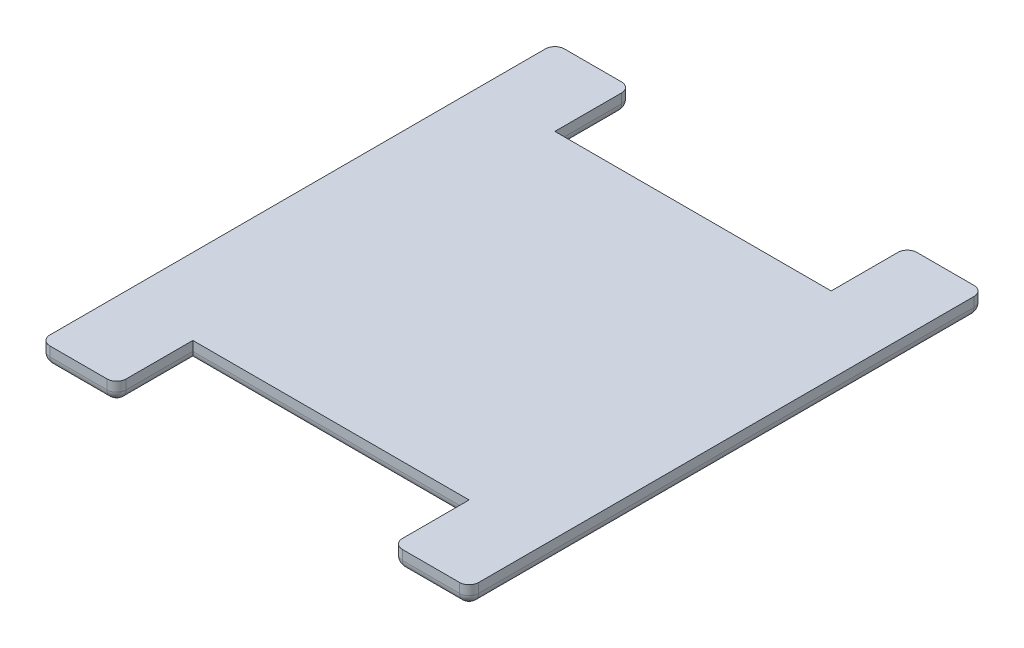
ISO-10303-21;
HEADER;
FILE_DESCRIPTION(('STEP AP214'),'2;1');
FILE_NAME('part.step','',(''),(''),'','','');
FILE_SCHEMA(('AUTOMOTIVE_DESIGN { 1 0 10303 214 1 1 1 1 }'));
ENDSEC;
DATA;
#1=APPLICATION_CONTEXT('core data for automotive mechanical design processes');
#2=APPLICATION_PROTOCOL_DEFINITION('international standard','automotive_design',2000,#1);
#3=PRODUCT_CONTEXT('',#1,'mechanical');
#4=PRODUCT('Part','Part','',(#3));
#5=PRODUCT_RELATED_PRODUCT_CATEGORY('part','',(#4));
#6=PRODUCT_DEFINITION_FORMATION('','',#4);
#7=PRODUCT_DEFINITION_CONTEXT('part definition',#1,'design');
#8=PRODUCT_DEFINITION('design','',#6,#7);
#9=PRODUCT_DEFINITION_SHAPE('','',#8);
#10=(LENGTH_UNIT() NAMED_UNIT(*) SI_UNIT(.MILLI.,.METRE.));
#11=(NAMED_UNIT(*) PLANE_ANGLE_UNIT() SI_UNIT($,.RADIAN.));
#12=(NAMED_UNIT(*) SI_UNIT($,.STERADIAN.) SOLID_ANGLE_UNIT());
#13=UNCERTAINTY_MEASURE_WITH_UNIT(LENGTH_MEASURE(1.E-05),#10,'distance_accuracy_value','');
#14=(GEOMETRIC_REPRESENTATION_CONTEXT(3) GLOBAL_UNCERTAINTY_ASSIGNED_CONTEXT((#13)) GLOBAL_UNIT_ASSIGNED_CONTEXT((#10,
#11,#12)) REPRESENTATION_CONTEXT('',''));
#15=CARTESIAN_POINT('',(0.,0.,0.));
#16=DIRECTION('',(0.,0.,1.));
#17=DIRECTION('',(1.,0.,0.));
#18=AXIS2_PLACEMENT_3D('',#15,#16,#17);
#19=CARTESIAN_POINT('',(14.5,-13.,-19.));
#20=DIRECTION('',(1.,0.,0.));
#21=DIRECTION('',(0.,0.,-1.));
#22=AXIS2_PLACEMENT_3D('',#19,#20,#21);
#23=PLANE('',#22);
#24=DIRECTION('',(0.,1.,0.));
#25=VECTOR('',#24,1.);
#26=CARTESIAN_POINT('',(14.5,-13.,-26.));
#27=LINE('',#26,#25);
#28=CARTESIAN_POINT('',(14.5,-11.,-26.));
#29=VERTEX_POINT('',#28);
#30=CARTESIAN_POINT('',(14.5,-12.,-26.));
#31=VERTEX_POINT('',#30);
#32=EDGE_CURVE('E56',#29,#31,#27,.F.);
#33=ORIENTED_EDGE('',*,*,#32,.T.);
#34=DIRECTION('',(0.,0.,-1.));
#35=VECTOR('',#34,1.);
#36=CARTESIAN_POINT('',(14.5,-12.,-19.));
#37=LINE('',#36,#35);
#38=CARTESIAN_POINT('',(14.5,-12.,-19.));
#39=VERTEX_POINT('',#38);
#40=EDGE_CURVE('E341',#31,#39,#37,.F.);
#41=ORIENTED_EDGE('',*,*,#40,.T.);
#42=DIRECTION('',(0.,1.,0.));
#43=VECTOR('',#42,1.);
#44=CARTESIAN_POINT('',(14.5,-13.,-19.));
#45=LINE('',#44,#43);
#46=CARTESIAN_POINT('',(14.5,-11.,-19.));
#47=VERTEX_POINT('',#46);
#48=EDGE_CURVE('E259',#39,#47,#45,.T.);
#49=ORIENTED_EDGE('',*,*,#48,.T.);
#50=DIRECTION('',(0.,0.,-1.));
#51=VECTOR('',#50,1.);
#52=CARTESIAN_POINT('',(14.5,-11.,-19.));
#53=LINE('',#52,#51);
#54=EDGE_CURVE('E436',#47,#29,#53,.T.);
#55=ORIENTED_EDGE('',*,*,#54,.T.);
#56=EDGE_LOOP('',(#33,#41,#49,#55));
#57=FACE_BOUND('',#56,.T.);
#58=ADVANCED_FACE('F39',(#57),#23,.F.);
#59=CARTESIAN_POINT('',(14.5,-13.,-27.));
#60=DIRECTION('',(0.,0.,1.));
#61=DIRECTION('',(1.,0.,0.));
#62=AXIS2_PLACEMENT_3D('',#59,#60,#61);
#63=PLANE('',#62);
#64=DIRECTION('',(1.,0.,0.));
#65=VECTOR('',#64,1.);
#66=CARTESIAN_POINT('',(14.5,-12.,-27.));
#67=LINE('',#66,#65);
#68=CARTESIAN_POINT('',(21.5,-12.,-27.));
#69=VERTEX_POINT('',#68);
#70=CARTESIAN_POINT('',(15.5,-12.,-27.));
#71=VERTEX_POINT('',#70);
#72=EDGE_CURVE('E336',#69,#71,#67,.F.);
#73=ORIENTED_EDGE('',*,*,#72,.T.);
#74=DIRECTION('',(0.,1.,0.));
#75=VECTOR('',#74,1.);
#76=CARTESIAN_POINT('',(15.5,-13.,-27.));
#77=LINE('',#76,#75);
#78=CARTESIAN_POINT('',(15.5,-11.,-27.));
#79=VERTEX_POINT('',#78);
#80=EDGE_CURVE('E338',#71,#79,#77,.T.);
#81=ORIENTED_EDGE('',*,*,#80,.T.);
#82=DIRECTION('',(1.,0.,0.));
#83=VECTOR('',#82,1.);
#84=CARTESIAN_POINT('',(14.5,-11.,-27.));
#85=LINE('',#84,#83);
#86=CARTESIAN_POINT('',(21.5,-11.,-27.));
#87=VERTEX_POINT('',#86);
#88=EDGE_CURVE('E441',#79,#87,#85,.T.);
#89=ORIENTED_EDGE('',*,*,#88,.T.);
#90=DIRECTION('',(0.,1.,0.));
#91=VECTOR('',#90,1.);
#92=CARTESIAN_POINT('',(21.5,-13.,-27.));
#93=LINE('',#92,#91);
#94=EDGE_CURVE('E334',#87,#69,#93,.F.);
#95=ORIENTED_EDGE('',*,*,#94,.T.);
#96=EDGE_LOOP('',(#73,#81,#89,#95));
#97=FACE_BOUND('',#96,.T.);
#98=ADVANCED_FACE('F496',(#97),#63,.F.);
#99=CARTESIAN_POINT('',(22.5,-13.,-27.));
#100=DIRECTION('',(-1.,0.,0.));
#101=DIRECTION('',(0.,0.,1.));
#102=AXIS2_PLACEMENT_3D('',#99,#100,#101);
#103=PLANE('',#102);
#104=DIRECTION('',(0.,0.,1.));
#105=VECTOR('',#104,1.);
#106=CARTESIAN_POINT('',(22.5,-11.,-27.));
#107=LINE('',#106,#105);
#108=CARTESIAN_POINT('',(22.5,-11.,-26.));
#109=VERTEX_POINT('',#108);
#110=CARTESIAN_POINT('',(22.5,-11.,26.));
#111=VERTEX_POINT('',#110);
#112=EDGE_CURVE('E444',#109,#111,#107,.T.);
#113=ORIENTED_EDGE('',*,*,#112,.T.);
#114=DIRECTION('',(0.,1.,0.));
#115=VECTOR('',#114,1.);
#116=CARTESIAN_POINT('',(22.5,-13.,26.));
#117=LINE('',#116,#115);
#118=CARTESIAN_POINT('',(22.5,-12.,26.));
#119=VERTEX_POINT('',#118);
#120=EDGE_CURVE('E332',#111,#119,#117,.F.);
#121=ORIENTED_EDGE('',*,*,#120,.T.);
#122=DIRECTION('',(0.,0.,1.));
#123=VECTOR('',#122,1.);
#124=CARTESIAN_POINT('',(22.5,-12.,-27.));
#125=LINE('',#124,#123);
#126=CARTESIAN_POINT('',(22.5,-12.,-26.));
#127=VERTEX_POINT('',#126);
#128=EDGE_CURVE('E330',#119,#127,#125,.F.);
#129=ORIENTED_EDGE('',*,*,#128,.T.);
#130=DIRECTION('',(0.,1.,0.));
#131=VECTOR('',#130,1.);
#132=CARTESIAN_POINT('',(22.5,-13.,-26.));
#133=LINE('',#132,#131);
#134=EDGE_CURVE('E328',#127,#109,#133,.T.);
#135=ORIENTED_EDGE('',*,*,#134,.T.);
#136=EDGE_LOOP('',(#113,#121,#129,#135));
#137=FACE_BOUND('',#136,.T.);
#138=ADVANCED_FACE('F475',(#137),#103,.F.);
#139=CARTESIAN_POINT('',(22.5,-13.,27.));
#140=DIRECTION('',(0.,0.,-1.));
#141=DIRECTION('',(-1.,0.,0.));
#142=AXIS2_PLACEMENT_3D('',#139,#140,#141);
#143=PLANE('',#142);
#144=DIRECTION('',(-1.,0.,0.));
#145=VECTOR('',#144,1.);
#146=CARTESIAN_POINT('',(22.5,-11.,27.));
#147=LINE('',#146,#145);
#148=CARTESIAN_POINT('',(21.5,-11.,27.));
#149=VERTEX_POINT('',#148);
#150=CARTESIAN_POINT('',(15.5,-11.,27.));
#151=VERTEX_POINT('',#150);
#152=EDGE_CURVE('E225',#149,#151,#147,.T.);
#153=ORIENTED_EDGE('',*,*,#152,.T.);
#154=DIRECTION('',(0.,1.,0.));
#155=VECTOR('',#154,1.);
#156=CARTESIAN_POINT('',(15.5,-13.,27.));
#157=LINE('',#156,#155);
#158=CARTESIAN_POINT('',(15.5,-12.,27.));
#159=VERTEX_POINT('',#158);
#160=EDGE_CURVE('E326',#151,#159,#157,.F.);
#161=ORIENTED_EDGE('',*,*,#160,.T.);
#162=DIRECTION('',(-1.,0.,0.));
#163=VECTOR('',#162,1.);
#164=CARTESIAN_POINT('',(22.5,-12.,27.));
#165=LINE('',#164,#163);
#166=CARTESIAN_POINT('',(21.5,-12.,27.));
#167=VERTEX_POINT('',#166);
#168=EDGE_CURVE('E324',#159,#167,#165,.F.);
#169=ORIENTED_EDGE('',*,*,#168,.T.);
#170=DIRECTION('',(0.,1.,0.));
#171=VECTOR('',#170,1.);
#172=CARTESIAN_POINT('',(21.5,-13.,27.));
#173=LINE('',#172,#171);
#174=EDGE_CURVE('E322',#167,#149,#173,.T.);
#175=ORIENTED_EDGE('',*,*,#174,.T.);
#176=EDGE_LOOP('',(#153,#161,#169,#175));
#177=FACE_BOUND('',#176,.T.);
#178=ADVANCED_FACE('F452',(#177),#143,.F.);
#179=CARTESIAN_POINT('',(14.5,-13.,27.));
#180=DIRECTION('',(1.,0.,0.));
#181=DIRECTION('',(0.,0.,-1.));
#182=AXIS2_PLACEMENT_3D('',#179,#180,#181);
#183=PLANE('',#182);
#184=DIRECTION('',(0.,1.,0.));
#185=VECTOR('',#184,1.);
#186=CARTESIAN_POINT('',(14.5,-13.,19.));
#187=LINE('',#186,#185);
#188=CARTESIAN_POINT('',(14.5,-12.,19.));
#189=VERTEX_POINT('',#188);
#190=CARTESIAN_POINT('',(14.5,-11.,19.));
#191=VERTEX_POINT('',#190);
#192=EDGE_CURVE('E218',#189,#191,#187,.T.);
#193=ORIENTED_EDGE('',*,*,#192,.F.);
#194=DIRECTION('',(0.,0.,-1.));
#195=VECTOR('',#194,1.);
#196=CARTESIAN_POINT('',(14.5,-12.,27.));
#197=LINE('',#196,#195);
#198=CARTESIAN_POINT('',(14.5,-12.,26.));
#199=VERTEX_POINT('',#198);
#200=EDGE_CURVE('E320',#189,#199,#197,.F.);
#201=ORIENTED_EDGE('',*,*,#200,.T.);
#202=DIRECTION('',(0.,1.,0.));
#203=VECTOR('',#202,1.);
#204=CARTESIAN_POINT('',(14.5,-13.,26.));
#205=LINE('',#204,#203);
#206=CARTESIAN_POINT('',(14.5,-11.,26.));
#207=VERTEX_POINT('',#206);
#208=EDGE_CURVE('E221',#199,#207,#205,.T.);
#209=ORIENTED_EDGE('',*,*,#208,.T.);
#210=DIRECTION('',(0.,0.,-1.));
#211=VECTOR('',#210,1.);
#212=CARTESIAN_POINT('',(14.5,-11.,27.));
#213=LINE('',#212,#211);
#214=EDGE_CURVE('E215',#207,#191,#213,.T.);
#215=ORIENTED_EDGE('',*,*,#214,.T.);
#216=EDGE_LOOP('',(#193,#201,#209,#215));
#217=FACE_BOUND('',#216,.T.);
#218=ADVANCED_FACE('F217',(#217),#183,.F.);
#219=CARTESIAN_POINT('',(14.5,-13.,19.));
#220=DIRECTION('',(0.,0.,-1.));
#221=DIRECTION('',(-1.,0.,0.));
#222=AXIS2_PLACEMENT_3D('',#219,#220,#221);
#223=PLANE('',#222);
#224=DIRECTION('',(0.,1.,0.));
#225=VECTOR('',#224,1.);
#226=CARTESIAN_POINT('',(-14.5,-13.,19.));
#227=LINE('',#226,#225);
#228=CARTESIAN_POINT('',(-14.5,-12.,19.));
#229=VERTEX_POINT('',#228);
#230=CARTESIAN_POINT('',(-14.5,-11.,19.));
#231=VERTEX_POINT('',#230);
#232=EDGE_CURVE('E235',#229,#231,#227,.T.);
#233=ORIENTED_EDGE('',*,*,#232,.F.);
#234=DIRECTION('',(-1.,0.,0.));
#235=VECTOR('',#234,1.);
#236=CARTESIAN_POINT('',(14.5,-12.,19.));
#237=LINE('',#236,#235);
#238=EDGE_CURVE('E233',#229,#189,#237,.F.);
#239=ORIENTED_EDGE('',*,*,#238,.T.);
#240=ORIENTED_EDGE('',*,*,#192,.T.);
#241=DIRECTION('',(-1.,0.,0.));
#242=VECTOR('',#241,1.);
#243=CARTESIAN_POINT('',(14.5,-11.,19.));
#244=LINE('',#243,#242);
#245=EDGE_CURVE('E224',#191,#231,#244,.T.);
#246=ORIENTED_EDGE('',*,*,#245,.T.);
#247=EDGE_LOOP('',(#233,#239,#240,#246));
#248=FACE_BOUND('',#247,.T.);
#249=ADVANCED_FACE('F230',(#248),#223,.F.);
#250=CARTESIAN_POINT('',(-14.5,-13.,27.));
#251=DIRECTION('',(-1.,0.,0.));
#252=DIRECTION('',(0.,0.,1.));
#253=AXIS2_PLACEMENT_3D('',#250,#251,#252);
#254=PLANE('',#253);
#255=DIRECTION('',(0.,1.,0.));
#256=VECTOR('',#255,1.);
#257=CARTESIAN_POINT('',(-14.5,-13.,26.));
#258=LINE('',#257,#256);
#259=CARTESIAN_POINT('',(-14.5,-11.,26.));
#260=VERTEX_POINT('',#259);
#261=CARTESIAN_POINT('',(-14.5,-12.,26.));
#262=VERTEX_POINT('',#261);
#263=EDGE_CURVE('E314',#260,#262,#258,.F.);
#264=ORIENTED_EDGE('',*,*,#263,.T.);
#265=DIRECTION('',(0.,0.,1.));
#266=VECTOR('',#265,1.);
#267=CARTESIAN_POINT('',(-14.5,-12.,19.));
#268=LINE('',#267,#266);
#269=EDGE_CURVE('E316',#262,#229,#268,.F.);
#270=ORIENTED_EDGE('',*,*,#269,.T.);
#271=ORIENTED_EDGE('',*,*,#232,.T.);
#272=DIRECTION('',(0.,0.,1.));
#273=VECTOR('',#272,1.);
#274=CARTESIAN_POINT('',(-14.5,-11.,27.));
#275=LINE('',#274,#273);
#276=EDGE_CURVE('E240',#231,#260,#275,.T.);
#277=ORIENTED_EDGE('',*,*,#276,.T.);
#278=EDGE_LOOP('',(#264,#270,#271,#277));
#279=FACE_BOUND('',#278,.T.);
#280=ADVANCED_FACE('F586',(#279),#254,.F.);
#281=CARTESIAN_POINT('',(-22.5,-13.,27.));
#282=DIRECTION('',(0.,0.,-1.));
#283=DIRECTION('',(-1.,0.,0.));
#284=AXIS2_PLACEMENT_3D('',#281,#282,#283);
#285=PLANE('',#284);
#286=DIRECTION('',(-1.,0.,0.));
#287=VECTOR('',#286,1.);
#288=CARTESIAN_POINT('',(-14.5,-12.,27.));
#289=LINE('',#288,#287);
#290=CARTESIAN_POINT('',(-21.5,-12.,27.));
#291=VERTEX_POINT('',#290);
#292=CARTESIAN_POINT('',(-15.5,-12.,27.));
#293=VERTEX_POINT('',#292);
#294=EDGE_CURVE('E310',#291,#293,#289,.F.);
#295=ORIENTED_EDGE('',*,*,#294,.T.);
#296=DIRECTION('',(0.,1.,0.));
#297=VECTOR('',#296,1.);
#298=CARTESIAN_POINT('',(-15.5,-13.,27.));
#299=LINE('',#298,#297);
#300=CARTESIAN_POINT('',(-15.5,-11.,27.));
#301=VERTEX_POINT('',#300);
#302=EDGE_CURVE('E312',#293,#301,#299,.T.);
#303=ORIENTED_EDGE('',*,*,#302,.T.);
#304=DIRECTION('',(-1.,0.,0.));
#305=VECTOR('',#304,1.);
#306=CARTESIAN_POINT('',(-22.5,-11.,27.));
#307=LINE('',#306,#305);
#308=CARTESIAN_POINT('',(-21.5,-11.,27.));
#309=VERTEX_POINT('',#308);
#310=EDGE_CURVE('E242',#301,#309,#307,.T.);
#311=ORIENTED_EDGE('',*,*,#310,.T.);
#312=DIRECTION('',(0.,1.,0.));
#313=VECTOR('',#312,1.);
#314=CARTESIAN_POINT('',(-21.5,-13.,27.));
#315=LINE('',#314,#313);
#316=EDGE_CURVE('E308',#309,#291,#315,.F.);
#317=ORIENTED_EDGE('',*,*,#316,.T.);
#318=EDGE_LOOP('',(#295,#303,#311,#317));
#319=FACE_BOUND('',#318,.T.);
#320=ADVANCED_FACE('F575',(#319),#285,.F.);
#321=CARTESIAN_POINT('',(-22.5,-13.,27.));
#322=DIRECTION('',(1.,0.,0.));
#323=DIRECTION('',(0.,0.,-1.));
#324=AXIS2_PLACEMENT_3D('',#321,#322,#323);
#325=PLANE('',#324);
#326=DIRECTION('',(0.,0.,-1.));
#327=VECTOR('',#326,1.);
#328=CARTESIAN_POINT('',(-22.5,-12.,27.));
#329=LINE('',#328,#327);
#330=CARTESIAN_POINT('',(-22.5,-12.,-26.));
#331=VERTEX_POINT('',#330);
#332=CARTESIAN_POINT('',(-22.5,-12.,26.));
#333=VERTEX_POINT('',#332);
#334=EDGE_CURVE('E304',#331,#333,#329,.F.);
#335=ORIENTED_EDGE('',*,*,#334,.T.);
#336=DIRECTION('',(0.,1.,0.));
#337=VECTOR('',#336,1.);
#338=CARTESIAN_POINT('',(-22.5,-13.,26.));
#339=LINE('',#338,#337);
#340=CARTESIAN_POINT('',(-22.5,-11.,26.));
#341=VERTEX_POINT('',#340);
#342=EDGE_CURVE('E306',#333,#341,#339,.T.);
#343=ORIENTED_EDGE('',*,*,#342,.T.);
#344=DIRECTION('',(0.,0.,-1.));
#345=VECTOR('',#344,1.);
#346=CARTESIAN_POINT('',(-22.5,-11.,27.));
#347=LINE('',#346,#345);
#348=CARTESIAN_POINT('',(-22.5,-11.,-26.));
#349=VERTEX_POINT('',#348);
#350=EDGE_CURVE('E248',#341,#349,#347,.T.);
#351=ORIENTED_EDGE('',*,*,#350,.T.);
#352=DIRECTION('',(0.,1.,0.));
#353=VECTOR('',#352,1.);
#354=CARTESIAN_POINT('',(-22.5,-13.,-26.));
#355=LINE('',#354,#353);
#356=EDGE_CURVE('E302',#349,#331,#355,.F.);
#357=ORIENTED_EDGE('',*,*,#356,.T.);
#358=EDGE_LOOP('',(#335,#343,#351,#357));
#359=FACE_BOUND('',#358,.T.);
#360=ADVANCED_FACE('F558',(#359),#325,.F.);
#361=CARTESIAN_POINT('',(-22.5,-13.,-27.));
#362=DIRECTION('',(0.,0.,1.));
#363=DIRECTION('',(1.,0.,0.));
#364=AXIS2_PLACEMENT_3D('',#361,#362,#363);
#365=PLANE('',#364);
#366=DIRECTION('',(1.,0.,0.));
#367=VECTOR('',#366,1.);
#368=CARTESIAN_POINT('',(-22.5,-12.,-27.));
#369=LINE('',#368,#367);
#370=CARTESIAN_POINT('',(-15.5,-12.,-27.));
#371=VERTEX_POINT('',#370);
#372=CARTESIAN_POINT('',(-21.5,-12.,-27.));
#373=VERTEX_POINT('',#372);
#374=EDGE_CURVE('E298',#371,#373,#369,.F.);
#375=ORIENTED_EDGE('',*,*,#374,.T.);
#376=DIRECTION('',(0.,1.,0.));
#377=VECTOR('',#376,1.);
#378=CARTESIAN_POINT('',(-21.5,-13.,-27.));
#379=LINE('',#378,#377);
#380=CARTESIAN_POINT('',(-21.5,-11.,-27.));
#381=VERTEX_POINT('',#380);
#382=EDGE_CURVE('E300',#373,#381,#379,.T.);
#383=ORIENTED_EDGE('',*,*,#382,.T.);
#384=DIRECTION('',(1.,0.,0.));
#385=VECTOR('',#384,1.);
#386=CARTESIAN_POINT('',(-22.5,-11.,-27.));
#387=LINE('',#386,#385);
#388=CARTESIAN_POINT('',(-15.5,-11.,-27.));
#389=VERTEX_POINT('',#388);
#390=EDGE_CURVE('E251',#381,#389,#387,.T.);
#391=ORIENTED_EDGE('',*,*,#390,.T.);
#392=DIRECTION('',(0.,1.,0.));
#393=VECTOR('',#392,1.);
#394=CARTESIAN_POINT('',(-15.5,-13.,-27.));
#395=LINE('',#394,#393);
#396=EDGE_CURVE('E296',#389,#371,#395,.F.);
#397=ORIENTED_EDGE('',*,*,#396,.T.);
#398=EDGE_LOOP('',(#375,#383,#391,#397));
#399=FACE_BOUND('',#398,.T.);
#400=ADVANCED_FACE('F541',(#399),#365,.F.);
#401=CARTESIAN_POINT('',(-14.5,-13.,-27.));
#402=DIRECTION('',(-1.,0.,0.));
#403=DIRECTION('',(0.,0.,1.));
#404=AXIS2_PLACEMENT_3D('',#401,#402,#403);
#405=PLANE('',#404);
#406=DIRECTION('',(0.,1.,0.));
#407=VECTOR('',#406,1.);
#408=CARTESIAN_POINT('',(-14.5,-13.,-19.));
#409=LINE('',#408,#407);
#410=CARTESIAN_POINT('',(-14.5,-12.,-19.));
#411=VERTEX_POINT('',#410);
#412=CARTESIAN_POINT('',(-14.5,-11.,-19.));
#413=VERTEX_POINT('',#412);
#414=EDGE_CURVE('E261',#411,#413,#409,.T.);
#415=ORIENTED_EDGE('',*,*,#414,.F.);
#416=DIRECTION('',(0.,0.,1.));
#417=VECTOR('',#416,1.);
#418=CARTESIAN_POINT('',(-14.5,-12.,-27.));
#419=LINE('',#418,#417);
#420=CARTESIAN_POINT('',(-14.5,-12.,-26.));
#421=VERTEX_POINT('',#420);
#422=EDGE_CURVE('E294',#411,#421,#419,.F.);
#423=ORIENTED_EDGE('',*,*,#422,.T.);
#424=DIRECTION('',(0.,1.,0.));
#425=VECTOR('',#424,1.);
#426=CARTESIAN_POINT('',(-14.5,-13.,-26.));
#427=LINE('',#426,#425);
#428=CARTESIAN_POINT('',(-14.5,-11.,-26.));
#429=VERTEX_POINT('',#428);
#430=EDGE_CURVE('E292',#421,#429,#427,.T.);
#431=ORIENTED_EDGE('',*,*,#430,.T.);
#432=DIRECTION('',(0.,0.,1.));
#433=VECTOR('',#432,1.);
#434=CARTESIAN_POINT('',(-14.5,-11.,-27.));
#435=LINE('',#434,#433);
#436=EDGE_CURVE('E254',#429,#413,#435,.T.);
#437=ORIENTED_EDGE('',*,*,#436,.T.);
#438=EDGE_LOOP('',(#415,#423,#431,#437));
#439=FACE_BOUND('',#438,.T.);
#440=ADVANCED_FACE('F524',(#439),#405,.F.);
#441=CARTESIAN_POINT('',(-14.5,-13.,-19.));
#442=DIRECTION('',(0.,0.,1.));
#443=DIRECTION('',(1.,0.,0.));
#444=AXIS2_PLACEMENT_3D('',#441,#442,#443);
#445=PLANE('',#444);
#446=ORIENTED_EDGE('',*,*,#48,.F.);
#447=DIRECTION('',(1.,0.,0.));
#448=VECTOR('',#447,1.);
#449=CARTESIAN_POINT('',(-14.5,-12.,-19.));
#450=LINE('',#449,#448);
#451=EDGE_CURVE('E289',#39,#411,#450,.F.);
#452=ORIENTED_EDGE('',*,*,#451,.T.);
#453=ORIENTED_EDGE('',*,*,#414,.T.);
#454=DIRECTION('',(1.,0.,0.));
#455=VECTOR('',#454,1.);
#456=CARTESIAN_POINT('',(-14.5,-11.,-19.));
#457=LINE('',#456,#455);
#458=EDGE_CURVE('E256',#413,#47,#457,.T.);
#459=ORIENTED_EDGE('',*,*,#458,.T.);
#460=EDGE_LOOP('',(#446,#452,#453,#459));
#461=FACE_BOUND('',#460,.T.);
#462=ADVANCED_FACE('F510',(#461),#445,.F.);
#463=CARTESIAN_POINT('',(0.,-13.,0.));
#464=DIRECTION('',(0.,-1.,0.));
#465=DIRECTION('',(0.,0.,-1.));
#466=AXIS2_PLACEMENT_3D('',#463,#464,#465);
#467=PLANE('',#466);
#468=DIRECTION('',(0.,0.,1.));
#469=VECTOR('',#468,1.);
#470=CARTESIAN_POINT('',(-15.5,-13.,-19.));
#471=LINE('',#470,#469);
#472=CARTESIAN_POINT('',(-15.5,-13.,-26.));
#473=VERTEX_POINT('',#472);
#474=CARTESIAN_POINT('',(-15.5,-13.,-18.));
#475=VERTEX_POINT('',#474);
#476=EDGE_CURVE('E284',#473,#475,#471,.T.);
#477=ORIENTED_EDGE('',*,*,#476,.T.);
#478=DIRECTION('',(1.,0.,0.));
#479=VECTOR('',#478,1.);
#480=CARTESIAN_POINT('',(14.5,-13.,-18.));
#481=LINE('',#480,#479);
#482=CARTESIAN_POINT('',(15.5,-13.,-18.));
#483=VERTEX_POINT('',#482);
#484=EDGE_CURVE('E286',#475,#483,#481,.T.);
#485=ORIENTED_EDGE('',*,*,#484,.T.);
#486=DIRECTION('',(0.,0.,-1.));
#487=VECTOR('',#486,1.);
#488=CARTESIAN_POINT('',(15.5,-13.,-27.));
#489=LINE('',#488,#487);
#490=CARTESIAN_POINT('',(15.5,-13.,-26.));
#491=VERTEX_POINT('',#490);
#492=EDGE_CURVE('E234',#483,#491,#489,.T.);
#493=ORIENTED_EDGE('',*,*,#492,.T.);
#494=DIRECTION('',(1.,0.,0.));
#495=VECTOR('',#494,1.);
#496=CARTESIAN_POINT('',(22.5,-13.,-26.));
#497=LINE('',#496,#495);
#498=CARTESIAN_POINT('',(21.5,-13.,-26.));
#499=VERTEX_POINT('',#498);
#500=EDGE_CURVE('E266',#491,#499,#497,.T.);
#501=ORIENTED_EDGE('',*,*,#500,.T.);
#502=DIRECTION('',(0.,0.,1.));
#503=VECTOR('',#502,1.);
#504=CARTESIAN_POINT('',(21.5,-13.,27.));
#505=LINE('',#504,#503);
#506=CARTESIAN_POINT('',(21.5,-13.,26.));
#507=VERTEX_POINT('',#506);
#508=EDGE_CURVE('E268',#499,#507,#505,.T.);
#509=ORIENTED_EDGE('',*,*,#508,.T.);
#510=DIRECTION('',(-1.,0.,0.));
#511=VECTOR('',#510,1.);
#512=CARTESIAN_POINT('',(14.5,-13.,26.));
#513=LINE('',#512,#511);
#514=CARTESIAN_POINT('',(15.5,-13.,26.));
#515=VERTEX_POINT('',#514);
#516=EDGE_CURVE('E270',#507,#515,#513,.T.);
#517=ORIENTED_EDGE('',*,*,#516,.T.);
#518=DIRECTION('',(0.,0.,-1.));
#519=VECTOR('',#518,1.);
#520=CARTESIAN_POINT('',(15.5,-13.,19.));
#521=LINE('',#520,#519);
#522=CARTESIAN_POINT('',(15.5,-13.,18.));
#523=VERTEX_POINT('',#522);
#524=EDGE_CURVE('E272',#515,#523,#521,.T.);
#525=ORIENTED_EDGE('',*,*,#524,.T.);
#526=DIRECTION('',(-1.,0.,0.));
#527=VECTOR('',#526,1.);
#528=CARTESIAN_POINT('',(-14.5,-13.,18.));
#529=LINE('',#528,#527);
#530=CARTESIAN_POINT('',(-15.5,-13.,18.));
#531=VERTEX_POINT('',#530);
#532=EDGE_CURVE('E274',#523,#531,#529,.T.);
#533=ORIENTED_EDGE('',*,*,#532,.T.);
#534=DIRECTION('',(0.,0.,1.));
#535=VECTOR('',#534,1.);
#536=CARTESIAN_POINT('',(-15.5,-13.,27.));
#537=LINE('',#536,#535);
#538=CARTESIAN_POINT('',(-15.5,-13.,26.));
#539=VERTEX_POINT('',#538);
#540=EDGE_CURVE('E276',#531,#539,#537,.T.);
#541=ORIENTED_EDGE('',*,*,#540,.T.);
#542=DIRECTION('',(-1.,0.,0.));
#543=VECTOR('',#542,1.);
#544=CARTESIAN_POINT('',(-22.5,-13.,26.));
#545=LINE('',#544,#543);
#546=CARTESIAN_POINT('',(-21.5,-13.,26.));
#547=VERTEX_POINT('',#546);
#548=EDGE_CURVE('E278',#539,#547,#545,.T.);
#549=ORIENTED_EDGE('',*,*,#548,.T.);
#550=DIRECTION('',(0.,0.,-1.));
#551=VECTOR('',#550,1.);
#552=CARTESIAN_POINT('',(-21.5,-13.,-27.));
#553=LINE('',#552,#551);
#554=CARTESIAN_POINT('',(-21.5,-13.,-26.));
#555=VERTEX_POINT('',#554);
#556=EDGE_CURVE('E280',#547,#555,#553,.T.);
#557=ORIENTED_EDGE('',*,*,#556,.T.);
#558=DIRECTION('',(1.,0.,0.));
#559=VECTOR('',#558,1.);
#560=CARTESIAN_POINT('',(-14.5,-13.,-26.));
#561=LINE('',#560,#559);
#562=EDGE_CURVE('E282',#555,#473,#561,.T.);
#563=ORIENTED_EDGE('',*,*,#562,.T.);
#564=EDGE_LOOP('',(#477,#485,#493,#501,#509,#517,#525,#533,#541,#549,#557,#563));
#565=FACE_BOUND('',#564,.T.);
#566=ADVANCED_FACE('F591',(#565),#467,.T.);
#567=CARTESIAN_POINT('',(0.,-11.,0.));
#568=DIRECTION('',(0.,-1.,0.));
#569=DIRECTION('',(0.,0.,-1.));
#570=AXIS2_PLACEMENT_3D('',#567,#568,#569);
#571=PLANE('',#570);
#572=ORIENTED_EDGE('',*,*,#310,.F.);
#573=CARTESIAN_POINT('',(-15.5,-11.,26.));
#574=DIRECTION('',(0.,-1.,0.));
#575=DIRECTION('',(0.,0.,-1.));
#576=AXIS2_PLACEMENT_3D('',#573,#574,#575);
#577=CIRCLE('',#576,1.);
#578=EDGE_CURVE('E11',#301,#260,#577,.F.);
#579=ORIENTED_EDGE('',*,*,#578,.T.);
#580=ORIENTED_EDGE('',*,*,#276,.F.);
#581=ORIENTED_EDGE('',*,*,#245,.F.);
#582=ORIENTED_EDGE('',*,*,#214,.F.);
#583=CARTESIAN_POINT('',(15.5,-11.,26.));
#584=DIRECTION('',(0.,-1.,0.));
#585=DIRECTION('',(0.,0.,-1.));
#586=AXIS2_PLACEMENT_3D('',#583,#584,#585);
#587=CIRCLE('',#586,1.);
#588=EDGE_CURVE('E352',#207,#151,#587,.F.);
#589=ORIENTED_EDGE('',*,*,#588,.T.);
#590=ORIENTED_EDGE('',*,*,#152,.F.);
#591=CARTESIAN_POINT('',(21.5,-11.,26.));
#592=DIRECTION('',(0.,-1.,0.));
#593=DIRECTION('',(0.,0.,-1.));
#594=AXIS2_PLACEMENT_3D('',#591,#592,#593);
#595=CIRCLE('',#594,1.);
#596=EDGE_CURVE('E350',#149,#111,#595,.F.);
#597=ORIENTED_EDGE('',*,*,#596,.T.);
#598=ORIENTED_EDGE('',*,*,#112,.F.);
#599=CARTESIAN_POINT('',(21.5,-11.,-26.));
#600=DIRECTION('',(0.,-1.,0.));
#601=DIRECTION('',(0.,0.,-1.));
#602=AXIS2_PLACEMENT_3D('',#599,#600,#601);
#603=CIRCLE('',#602,1.);
#604=EDGE_CURVE('E343',#109,#87,#603,.F.);
#605=ORIENTED_EDGE('',*,*,#604,.T.);
#606=ORIENTED_EDGE('',*,*,#88,.F.);
#607=CARTESIAN_POINT('',(15.5,-11.,-26.));
#608=DIRECTION('',(0.,-1.,0.));
#609=DIRECTION('',(0.,0.,-1.));
#610=AXIS2_PLACEMENT_3D('',#607,#608,#609);
#611=CIRCLE('',#610,1.);
#612=EDGE_CURVE('E64',#79,#29,#611,.F.);
#613=ORIENTED_EDGE('',*,*,#612,.T.);
#614=ORIENTED_EDGE('',*,*,#54,.F.);
#615=ORIENTED_EDGE('',*,*,#458,.F.);
#616=ORIENTED_EDGE('',*,*,#436,.F.);
#617=CARTESIAN_POINT('',(-15.5,-11.,-26.));
#618=DIRECTION('',(0.,-1.,0.));
#619=DIRECTION('',(0.,0.,-1.));
#620=AXIS2_PLACEMENT_3D('',#617,#618,#619);
#621=CIRCLE('',#620,1.);
#622=EDGE_CURVE('E346',#429,#389,#621,.F.);
#623=ORIENTED_EDGE('',*,*,#622,.T.);
#624=ORIENTED_EDGE('',*,*,#390,.F.);
#625=CARTESIAN_POINT('',(-21.5,-11.,-26.));
#626=DIRECTION('',(0.,-1.,0.));
#627=DIRECTION('',(0.,0.,-1.));
#628=AXIS2_PLACEMENT_3D('',#625,#626,#627);
#629=CIRCLE('',#628,1.);
#630=EDGE_CURVE('E348',#381,#349,#629,.F.);
#631=ORIENTED_EDGE('',*,*,#630,.T.);
#632=ORIENTED_EDGE('',*,*,#350,.F.);
#633=CARTESIAN_POINT('',(-21.5,-11.,26.));
#634=DIRECTION('',(0.,-1.,0.));
#635=DIRECTION('',(0.,0.,-1.));
#636=AXIS2_PLACEMENT_3D('',#633,#634,#635);
#637=CIRCLE('',#636,1.);
#638=EDGE_CURVE('E48',#341,#309,#637,.F.);
#639=ORIENTED_EDGE('',*,*,#638,.T.);
#640=EDGE_LOOP('',(#572,#579,#580,#581,#582,#589,#590,#597,#598,#605,#606,#613,#614,#615,#616,
#623,#624,#631,#632,#639));
#641=FACE_BOUND('',#640,.T.);
#642=ADVANCED_FACE('F238',(#641),#571,.F.);
#643=CARTESIAN_POINT('',(0.,-12.,18.));
#644=DIRECTION('',(1.,0.,0.));
#645=DIRECTION('',(0.,0.,-1.));
#646=AXIS2_PLACEMENT_3D('',#643,#644,#645);
#647=CYLINDRICAL_SURFACE('',#646,1.);
#648=CARTESIAN_POINT('',(15.5,-12.,18.));
#649=DIRECTION('',(0.707106781186548,0.,0.707106781186547));
#650=DIRECTION('',(0.707106781186547,0.,-0.707106781186548));
#651=AXIS2_PLACEMENT_3D('',#648,#649,#650);
#652=ELLIPSE('',#651,1.41421356237309,1.);
#653=EDGE_CURVE('E430',#189,#523,#652,.T.);
#654=ORIENTED_EDGE('',*,*,#653,.F.);
#655=ORIENTED_EDGE('',*,*,#238,.F.);
#656=CARTESIAN_POINT('',(-15.5,-12.,18.));
#657=DIRECTION('',(0.707106781186547,0.,-0.707106781186548));
#658=DIRECTION('',(-0.707106781186548,0.,-0.707106781186547));
#659=AXIS2_PLACEMENT_3D('',#656,#657,#658);
#660=ELLIPSE('',#659,1.4142135623731,1.);
#661=EDGE_CURVE('E43',#531,#229,#660,.F.);
#662=ORIENTED_EDGE('',*,*,#661,.F.);
#663=ORIENTED_EDGE('',*,*,#532,.F.);
#664=EDGE_LOOP('',(#654,#655,#662,#663));
#665=FACE_BOUND('',#664,.T.);
#666=ADVANCED_FACE('F41',(#665),#647,.T.);
#667=CARTESIAN_POINT('',(-15.5,-13.,26.));
#668=DIRECTION('',(0.,1.,0.));
#669=DIRECTION('',(0.,0.,1.));
#670=AXIS2_PLACEMENT_3D('',#667,#668,#669);
#671=CYLINDRICAL_SURFACE('',#670,1.);
#672=ORIENTED_EDGE('',*,*,#578,.F.);
#673=ORIENTED_EDGE('',*,*,#302,.F.);
#674=CARTESIAN_POINT('',(-15.5,-12.,26.));
#675=DIRECTION('',(0.,-1.,0.));
#676=DIRECTION('',(0.,0.,-1.));
#677=AXIS2_PLACEMENT_3D('',#674,#675,#676);
#678=CIRCLE('',#677,1.);
#679=EDGE_CURVE('E428',#262,#293,#678,.T.);
#680=ORIENTED_EDGE('',*,*,#679,.F.);
#681=ORIENTED_EDGE('',*,*,#263,.F.);
#682=EDGE_LOOP('',(#672,#673,#680,#681));
#683=FACE_BOUND('',#682,.T.);
#684=ADVANCED_FACE('F579',(#683),#671,.T.);
#685=CARTESIAN_POINT('',(-15.5,-12.,0.));
#686=DIRECTION('',(0.,0.,-1.));
#687=DIRECTION('',(-1.,0.,0.));
#688=AXIS2_PLACEMENT_3D('',#685,#686,#687);
#689=CYLINDRICAL_SURFACE('',#688,1.);
#690=ORIENTED_EDGE('',*,*,#661,.T.);
#691=ORIENTED_EDGE('',*,*,#269,.F.);
#692=CARTESIAN_POINT('',(-15.5,-12.,26.));
#693=DIRECTION('',(0.,0.,1.));
#694=DIRECTION('',(1.,0.,0.));
#695=AXIS2_PLACEMENT_3D('',#692,#693,#694);
#696=CIRCLE('',#695,1.);
#697=EDGE_CURVE('E425',#539,#262,#696,.T.);
#698=ORIENTED_EDGE('',*,*,#697,.F.);
#699=ORIENTED_EDGE('',*,*,#540,.F.);
#700=EDGE_LOOP('',(#690,#691,#698,#699));
#701=FACE_BOUND('',#700,.T.);
#702=ADVANCED_FACE('F584',(#701),#689,.T.);
#703=CARTESIAN_POINT('',(15.5,-12.,0.));
#704=DIRECTION('',(0.,0.,1.));
#705=DIRECTION('',(1.,0.,0.));
#706=AXIS2_PLACEMENT_3D('',#703,#704,#705);
#707=CYLINDRICAL_SURFACE('',#706,1.);
#708=ORIENTED_EDGE('',*,*,#653,.T.);
#709=ORIENTED_EDGE('',*,*,#524,.F.);
#710=CARTESIAN_POINT('',(15.5,-12.,26.));
#711=DIRECTION('',(0.,0.,1.));
#712=DIRECTION('',(1.,0.,0.));
#713=AXIS2_PLACEMENT_3D('',#710,#711,#712);
#714=CIRCLE('',#713,1.);
#715=EDGE_CURVE('E422',#199,#515,#714,.T.);
#716=ORIENTED_EDGE('',*,*,#715,.F.);
#717=ORIENTED_EDGE('',*,*,#200,.F.);
#718=EDGE_LOOP('',(#708,#709,#716,#717));
#719=FACE_BOUND('',#718,.T.);
#720=ADVANCED_FACE('F589',(#719),#707,.T.);
#721=CARTESIAN_POINT('',(15.5,-13.,26.));
#722=DIRECTION('',(0.,1.,0.));
#723=DIRECTION('',(0.,0.,1.));
#724=AXIS2_PLACEMENT_3D('',#721,#722,#723);
#725=CYLINDRICAL_SURFACE('',#724,1.);
#726=ORIENTED_EDGE('',*,*,#588,.F.);
#727=ORIENTED_EDGE('',*,*,#208,.F.);
#728=CARTESIAN_POINT('',(15.5,-12.,26.));
#729=DIRECTION('',(0.,-1.,0.));
#730=DIRECTION('',(0.,0.,-1.));
#731=AXIS2_PLACEMENT_3D('',#728,#729,#730);
#732=CIRCLE('',#731,1.);
#733=EDGE_CURVE('E419',#159,#199,#732,.T.);
#734=ORIENTED_EDGE('',*,*,#733,.F.);
#735=ORIENTED_EDGE('',*,*,#160,.F.);
#736=EDGE_LOOP('',(#726,#727,#734,#735));
#737=FACE_BOUND('',#736,.T.);
#738=ADVANCED_FACE('F457',(#737),#725,.T.);
#739=CARTESIAN_POINT('',(-15.5,-12.,26.));
#740=DIRECTION('',(1.,0.,0.));
#741=DIRECTION('',(0.,0.,-1.));
#742=AXIS2_PLACEMENT_3D('',#739,#740,#741);
#743=SPHERICAL_SURFACE('',#742,1.);
#744=ORIENTED_EDGE('',*,*,#697,.T.);
#745=ORIENTED_EDGE('',*,*,#679,.T.);
#746=CARTESIAN_POINT('',(-15.5,-12.,26.));
#747=DIRECTION('',(1.,0.,0.));
#748=DIRECTION('',(0.,0.,-1.));
#749=AXIS2_PLACEMENT_3D('',#746,#747,#748);
#750=CIRCLE('',#749,1.);
#751=EDGE_CURVE('E416',#539,#293,#750,.F.);
#752=ORIENTED_EDGE('',*,*,#751,.F.);
#753=EDGE_LOOP('',(#744,#745,#752));
#754=FACE_BOUND('',#753,.T.);
#755=ADVANCED_FACE('F582',(#754),#743,.T.);
#756=CARTESIAN_POINT('',(15.5,-12.,26.));
#757=DIRECTION('',(-1.,0.,0.));
#758=DIRECTION('',(0.,0.,1.));
#759=AXIS2_PLACEMENT_3D('',#756,#757,#758);
#760=SPHERICAL_SURFACE('',#759,1.);
#761=ORIENTED_EDGE('',*,*,#733,.T.);
#762=ORIENTED_EDGE('',*,*,#715,.T.);
#763=CARTESIAN_POINT('',(15.5,-12.,26.));
#764=DIRECTION('',(-1.,0.,0.));
#765=DIRECTION('',(0.,0.,1.));
#766=AXIS2_PLACEMENT_3D('',#763,#764,#765);
#767=CIRCLE('',#766,1.);
#768=EDGE_CURVE('E413',#159,#515,#767,.F.);
#769=ORIENTED_EDGE('',*,*,#768,.F.);
#770=EDGE_LOOP('',(#761,#762,#769));
#771=FACE_BOUND('',#770,.T.);
#772=ADVANCED_FACE('F462',(#771),#760,.T.);
#773=CARTESIAN_POINT('',(-21.5,-13.,26.));
#774=DIRECTION('',(0.,1.,0.));
#775=DIRECTION('',(0.,0.,1.));
#776=AXIS2_PLACEMENT_3D('',#773,#774,#775);
#777=CYLINDRICAL_SURFACE('',#776,1.);
#778=ORIENTED_EDGE('',*,*,#638,.F.);
#779=ORIENTED_EDGE('',*,*,#342,.F.);
#780=CARTESIAN_POINT('',(-21.5,-12.,26.));
#781=DIRECTION('',(0.,-1.,0.));
#782=DIRECTION('',(0.,0.,-1.));
#783=AXIS2_PLACEMENT_3D('',#780,#781,#782);
#784=CIRCLE('',#783,1.);
#785=EDGE_CURVE('E410',#291,#333,#784,.T.);
#786=ORIENTED_EDGE('',*,*,#785,.F.);
#787=ORIENTED_EDGE('',*,*,#316,.F.);
#788=EDGE_LOOP('',(#778,#779,#786,#787));
#789=FACE_BOUND('',#788,.T.);
#790=ADVANCED_FACE('F563',(#789),#777,.T.);
#791=CARTESIAN_POINT('',(0.,-12.,26.));
#792=DIRECTION('',(1.,0.,0.));
#793=DIRECTION('',(0.,0.,-1.));
#794=AXIS2_PLACEMENT_3D('',#791,#792,#793);
#795=CYLINDRICAL_SURFACE('',#794,1.);
#796=ORIENTED_EDGE('',*,*,#751,.T.);
#797=ORIENTED_EDGE('',*,*,#294,.F.);
#798=CARTESIAN_POINT('',(-21.5,-12.,26.));
#799=DIRECTION('',(-1.,0.,0.));
#800=DIRECTION('',(0.,0.,1.));
#801=AXIS2_PLACEMENT_3D('',#798,#799,#800);
#802=CIRCLE('',#801,1.);
#803=EDGE_CURVE('E407',#547,#291,#802,.T.);
#804=ORIENTED_EDGE('',*,*,#803,.F.);
#805=ORIENTED_EDGE('',*,*,#548,.F.);
#806=EDGE_LOOP('',(#796,#797,#804,#805));
#807=FACE_BOUND('',#806,.T.);
#808=ADVANCED_FACE('F571',(#807),#795,.T.);
#809=CARTESIAN_POINT('',(0.,-12.,26.));
#810=DIRECTION('',(1.,0.,0.));
#811=DIRECTION('',(0.,0.,-1.));
#812=AXIS2_PLACEMENT_3D('',#809,#810,#811);
#813=CYLINDRICAL_SURFACE('',#812,1.);
#814=ORIENTED_EDGE('',*,*,#768,.T.);
#815=ORIENTED_EDGE('',*,*,#516,.F.);
#816=CARTESIAN_POINT('',(21.5,-12.,26.));
#817=DIRECTION('',(1.,0.,0.));
#818=DIRECTION('',(0.,0.,-1.));
#819=AXIS2_PLACEMENT_3D('',#816,#817,#818);
#820=CIRCLE('',#819,1.);
#821=EDGE_CURVE('E404',#167,#507,#820,.T.);
#822=ORIENTED_EDGE('',*,*,#821,.F.);
#823=ORIENTED_EDGE('',*,*,#168,.F.);
#824=EDGE_LOOP('',(#814,#815,#822,#823));
#825=FACE_BOUND('',#824,.T.);
#826=ADVANCED_FACE('F466',(#825),#813,.T.);
#827=CARTESIAN_POINT('',(21.5,-13.,26.));
#828=DIRECTION('',(0.,1.,0.));
#829=DIRECTION('',(0.,0.,1.));
#830=AXIS2_PLACEMENT_3D('',#827,#828,#829);
#831=CYLINDRICAL_SURFACE('',#830,1.);
#832=ORIENTED_EDGE('',*,*,#596,.F.);
#833=ORIENTED_EDGE('',*,*,#174,.F.);
#834=CARTESIAN_POINT('',(21.5,-12.,26.));
#835=DIRECTION('',(0.,-1.,0.));
#836=DIRECTION('',(0.,0.,-1.));
#837=AXIS2_PLACEMENT_3D('',#834,#835,#836);
#838=CIRCLE('',#837,1.);
#839=EDGE_CURVE('E401',#119,#167,#838,.T.);
#840=ORIENTED_EDGE('',*,*,#839,.F.);
#841=ORIENTED_EDGE('',*,*,#120,.F.);
#842=EDGE_LOOP('',(#832,#833,#840,#841));
#843=FACE_BOUND('',#842,.T.);
#844=ADVANCED_FACE('F469',(#843),#831,.T.);
#845=CARTESIAN_POINT('',(-21.5,-12.,26.));
#846=DIRECTION('',(0.,0.,1.));
#847=DIRECTION('',(1.,0.,0.));
#848=AXIS2_PLACEMENT_3D('',#845,#846,#847);
#849=SPHERICAL_SURFACE('',#848,1.);
#850=ORIENTED_EDGE('',*,*,#803,.T.);
#851=ORIENTED_EDGE('',*,*,#785,.T.);
#852=CARTESIAN_POINT('',(-21.5,-12.,26.));
#853=DIRECTION('',(0.,0.,1.));
#854=DIRECTION('',(1.,0.,0.));
#855=AXIS2_PLACEMENT_3D('',#852,#853,#854);
#856=CIRCLE('',#855,1.);
#857=EDGE_CURVE('E398',#547,#333,#856,.F.);
#858=ORIENTED_EDGE('',*,*,#857,.F.);
#859=EDGE_LOOP('',(#850,#851,#858));
#860=FACE_BOUND('',#859,.T.);
#861=ADVANCED_FACE('F566',(#860),#849,.T.);
#862=CARTESIAN_POINT('',(21.5,-12.,26.));
#863=DIRECTION('',(0.,0.,1.));
#864=DIRECTION('',(1.,0.,0.));
#865=AXIS2_PLACEMENT_3D('',#862,#863,#864);
#866=SPHERICAL_SURFACE('',#865,1.);
#867=ORIENTED_EDGE('',*,*,#839,.T.);
#868=ORIENTED_EDGE('',*,*,#821,.T.);
#869=CARTESIAN_POINT('',(21.5,-12.,26.));
#870=DIRECTION('',(0.,0.,1.));
#871=DIRECTION('',(1.,0.,0.));
#872=AXIS2_PLACEMENT_3D('',#869,#870,#871);
#873=CIRCLE('',#872,1.);
#874=EDGE_CURVE('E395',#119,#507,#873,.F.);
#875=ORIENTED_EDGE('',*,*,#874,.F.);
#876=EDGE_LOOP('',(#867,#868,#875));
#877=FACE_BOUND('',#876,.T.);
#878=ADVANCED_FACE('F593',(#877),#866,.T.);
#879=CARTESIAN_POINT('',(-21.5,-13.,-26.));
#880=DIRECTION('',(0.,1.,0.));
#881=DIRECTION('',(0.,0.,1.));
#882=AXIS2_PLACEMENT_3D('',#879,#880,#881);
#883=CYLINDRICAL_SURFACE('',#882,1.);
#884=ORIENTED_EDGE('',*,*,#630,.F.);
#885=ORIENTED_EDGE('',*,*,#382,.F.);
#886=CARTESIAN_POINT('',(-21.5,-12.,-26.));
#887=DIRECTION('',(0.,-1.,0.));
#888=DIRECTION('',(0.,0.,-1.));
#889=AXIS2_PLACEMENT_3D('',#886,#887,#888);
#890=CIRCLE('',#889,1.);
#891=EDGE_CURVE('E392',#331,#373,#890,.T.);
#892=ORIENTED_EDGE('',*,*,#891,.F.);
#893=ORIENTED_EDGE('',*,*,#356,.F.);
#894=EDGE_LOOP('',(#884,#885,#892,#893));
#895=FACE_BOUND('',#894,.T.);
#896=ADVANCED_FACE('F546',(#895),#883,.T.);
#897=CARTESIAN_POINT('',(-21.5,-12.,0.));
#898=DIRECTION('',(0.,0.,1.));
#899=DIRECTION('',(1.,0.,0.));
#900=AXIS2_PLACEMENT_3D('',#897,#898,#899);
#901=CYLINDRICAL_SURFACE('',#900,1.);
#902=ORIENTED_EDGE('',*,*,#857,.T.);
#903=ORIENTED_EDGE('',*,*,#334,.F.);
#904=CARTESIAN_POINT('',(-21.5,-12.,-26.));
#905=DIRECTION('',(0.,0.,-1.));
#906=DIRECTION('',(-1.,0.,0.));
#907=AXIS2_PLACEMENT_3D('',#904,#905,#906);
#908=CIRCLE('',#907,1.);
#909=EDGE_CURVE('E389',#555,#331,#908,.T.);
#910=ORIENTED_EDGE('',*,*,#909,.F.);
#911=ORIENTED_EDGE('',*,*,#556,.F.);
#912=EDGE_LOOP('',(#902,#903,#910,#911));
#913=FACE_BOUND('',#912,.T.);
#914=ADVANCED_FACE('F554',(#913),#901,.T.);
#915=CARTESIAN_POINT('',(21.5,-12.,0.));
#916=DIRECTION('',(0.,0.,-1.));
#917=DIRECTION('',(-1.,0.,0.));
#918=AXIS2_PLACEMENT_3D('',#915,#916,#917);
#919=CYLINDRICAL_SURFACE('',#918,1.);
#920=ORIENTED_EDGE('',*,*,#874,.T.);
#921=ORIENTED_EDGE('',*,*,#508,.F.);
#922=CARTESIAN_POINT('',(21.5,-12.,-26.));
#923=DIRECTION('',(0.,0.,-1.));
#924=DIRECTION('',(-1.,0.,0.));
#925=AXIS2_PLACEMENT_3D('',#922,#923,#924);
#926=CIRCLE('',#925,1.);
#927=EDGE_CURVE('E386',#127,#499,#926,.T.);
#928=ORIENTED_EDGE('',*,*,#927,.F.);
#929=ORIENTED_EDGE('',*,*,#128,.F.);
#930=EDGE_LOOP('',(#920,#921,#928,#929));
#931=FACE_BOUND('',#930,.T.);
#932=ADVANCED_FACE('F486',(#931),#919,.T.);
#933=CARTESIAN_POINT('',(21.5,-13.,-26.));
#934=DIRECTION('',(0.,1.,0.));
#935=DIRECTION('',(0.,0.,1.));
#936=AXIS2_PLACEMENT_3D('',#933,#934,#935);
#937=CYLINDRICAL_SURFACE('',#936,1.);
#938=ORIENTED_EDGE('',*,*,#604,.F.);
#939=ORIENTED_EDGE('',*,*,#134,.F.);
#940=CARTESIAN_POINT('',(21.5,-12.,-26.));
#941=DIRECTION('',(0.,-1.,0.));
#942=DIRECTION('',(0.,0.,-1.));
#943=AXIS2_PLACEMENT_3D('',#940,#941,#942);
#944=CIRCLE('',#943,1.);
#945=EDGE_CURVE('E383',#69,#127,#944,.T.);
#946=ORIENTED_EDGE('',*,*,#945,.F.);
#947=ORIENTED_EDGE('',*,*,#94,.F.);
#948=EDGE_LOOP('',(#938,#939,#946,#947));
#949=FACE_BOUND('',#948,.T.);
#950=ADVANCED_FACE('F481',(#949),#937,.T.);
#951=CARTESIAN_POINT('',(-21.5,-12.,-26.));
#952=DIRECTION('',(-1.,0.,0.));
#953=DIRECTION('',(0.,0.,1.));
#954=AXIS2_PLACEMENT_3D('',#951,#952,#953);
#955=SPHERICAL_SURFACE('',#954,1.);
#956=ORIENTED_EDGE('',*,*,#909,.T.);
#957=ORIENTED_EDGE('',*,*,#891,.T.);
#958=CARTESIAN_POINT('',(-21.5,-12.,-26.));
#959=DIRECTION('',(-1.,0.,0.));
#960=DIRECTION('',(0.,0.,1.));
#961=AXIS2_PLACEMENT_3D('',#958,#959,#960);
#962=CIRCLE('',#961,1.);
#963=EDGE_CURVE('E380',#555,#373,#962,.F.);
#964=ORIENTED_EDGE('',*,*,#963,.F.);
#965=EDGE_LOOP('',(#956,#957,#964));
#966=FACE_BOUND('',#965,.T.);
#967=ADVANCED_FACE('F549',(#966),#955,.T.);
#968=CARTESIAN_POINT('',(21.5,-12.,-26.));
#969=DIRECTION('',(1.,0.,0.));
#970=DIRECTION('',(0.,0.,-1.));
#971=AXIS2_PLACEMENT_3D('',#968,#969,#970);
#972=SPHERICAL_SURFACE('',#971,1.);
#973=ORIENTED_EDGE('',*,*,#945,.T.);
#974=ORIENTED_EDGE('',*,*,#927,.T.);
#975=CARTESIAN_POINT('',(21.5,-12.,-26.));
#976=DIRECTION('',(1.,0.,0.));
#977=DIRECTION('',(0.,0.,-1.));
#978=AXIS2_PLACEMENT_3D('',#975,#976,#977);
#979=CIRCLE('',#978,1.);
#980=EDGE_CURVE('E377',#69,#499,#979,.F.);
#981=ORIENTED_EDGE('',*,*,#980,.F.);
#982=EDGE_LOOP('',(#973,#974,#981));
#983=FACE_BOUND('',#982,.T.);
#984=ADVANCED_FACE('F488',(#983),#972,.T.);
#985=CARTESIAN_POINT('',(-15.5,-13.,-26.));
#986=DIRECTION('',(0.,1.,0.));
#987=DIRECTION('',(0.,0.,1.));
#988=AXIS2_PLACEMENT_3D('',#985,#986,#987);
#989=CYLINDRICAL_SURFACE('',#988,1.);
#990=ORIENTED_EDGE('',*,*,#622,.F.);
#991=ORIENTED_EDGE('',*,*,#430,.F.);
#992=CARTESIAN_POINT('',(-15.5,-12.,-26.));
#993=DIRECTION('',(0.,-1.,0.));
#994=DIRECTION('',(0.,0.,-1.));
#995=AXIS2_PLACEMENT_3D('',#992,#993,#994);
#996=CIRCLE('',#995,1.);
#997=EDGE_CURVE('E374',#371,#421,#996,.T.);
#998=ORIENTED_EDGE('',*,*,#997,.F.);
#999=ORIENTED_EDGE('',*,*,#396,.F.);
#1000=EDGE_LOOP('',(#990,#991,#998,#999));
#1001=FACE_BOUND('',#1000,.T.);
#1002=ADVANCED_FACE('F529',(#1001),#989,.T.);
#1003=CARTESIAN_POINT('',(0.,-12.,-26.));
#1004=DIRECTION('',(-1.,0.,0.));
#1005=DIRECTION('',(0.,0.,1.));
#1006=AXIS2_PLACEMENT_3D('',#1003,#1004,#1005);
#1007=CYLINDRICAL_SURFACE('',#1006,1.);
#1008=ORIENTED_EDGE('',*,*,#963,.T.);
#1009=ORIENTED_EDGE('',*,*,#374,.F.);
#1010=CARTESIAN_POINT('',(-15.5,-12.,-26.));
#1011=DIRECTION('',(1.,0.,0.));
#1012=DIRECTION('',(0.,0.,-1.));
#1013=AXIS2_PLACEMENT_3D('',#1010,#1011,#1012);
#1014=CIRCLE('',#1013,1.);
#1015=EDGE_CURVE('E371',#473,#371,#1014,.T.);
#1016=ORIENTED_EDGE('',*,*,#1015,.F.);
#1017=ORIENTED_EDGE('',*,*,#562,.F.);
#1018=EDGE_LOOP('',(#1008,#1009,#1016,#1017));
#1019=FACE_BOUND('',#1018,.T.);
#1020=ADVANCED_FACE('F537',(#1019),#1007,.T.);
#1021=CARTESIAN_POINT('',(0.,-12.,-26.));
#1022=DIRECTION('',(-1.,0.,0.));
#1023=DIRECTION('',(0.,0.,1.));
#1024=AXIS2_PLACEMENT_3D('',#1021,#1022,#1023);
#1025=CYLINDRICAL_SURFACE('',#1024,1.);
#1026=ORIENTED_EDGE('',*,*,#980,.T.);
#1027=ORIENTED_EDGE('',*,*,#500,.F.);
#1028=CARTESIAN_POINT('',(15.5,-12.,-26.));
#1029=DIRECTION('',(-1.,0.,0.));
#1030=DIRECTION('',(0.,0.,1.));
#1031=AXIS2_PLACEMENT_3D('',#1028,#1029,#1030);
#1032=CIRCLE('',#1031,1.);
#1033=EDGE_CURVE('E368',#71,#491,#1032,.T.);
#1034=ORIENTED_EDGE('',*,*,#1033,.F.);
#1035=ORIENTED_EDGE('',*,*,#72,.F.);
#1036=EDGE_LOOP('',(#1026,#1027,#1034,#1035));
#1037=FACE_BOUND('',#1036,.T.);
#1038=ADVANCED_FACE('F493',(#1037),#1025,.T.);
#1039=CARTESIAN_POINT('',(15.5,-13.,-26.));
#1040=DIRECTION('',(0.,1.,0.));
#1041=DIRECTION('',(0.,0.,1.));
#1042=AXIS2_PLACEMENT_3D('',#1039,#1040,#1041);
#1043=CYLINDRICAL_SURFACE('',#1042,1.);
#1044=ORIENTED_EDGE('',*,*,#612,.F.);
#1045=ORIENTED_EDGE('',*,*,#80,.F.);
#1046=CARTESIAN_POINT('',(15.5,-12.,-26.));
#1047=DIRECTION('',(0.,-1.,0.));
#1048=DIRECTION('',(0.,0.,-1.));
#1049=AXIS2_PLACEMENT_3D('',#1046,#1047,#1048);
#1050=CIRCLE('',#1049,1.);
#1051=EDGE_CURVE('E365',#31,#71,#1050,.T.);
#1052=ORIENTED_EDGE('',*,*,#1051,.F.);
#1053=ORIENTED_EDGE('',*,*,#32,.F.);
#1054=EDGE_LOOP('',(#1044,#1045,#1052,#1053));
#1055=FACE_BOUND('',#1054,.T.);
#1056=ADVANCED_FACE('F498',(#1055),#1043,.T.);
#1057=CARTESIAN_POINT('',(-15.5,-12.,-26.));
#1058=DIRECTION('',(0.,0.,-1.));
#1059=DIRECTION('',(-1.,0.,0.));
#1060=AXIS2_PLACEMENT_3D('',#1057,#1058,#1059);
#1061=SPHERICAL_SURFACE('',#1060,1.);
#1062=ORIENTED_EDGE('',*,*,#1015,.T.);
#1063=ORIENTED_EDGE('',*,*,#997,.T.);
#1064=CARTESIAN_POINT('',(-15.5,-12.,-26.));
#1065=DIRECTION('',(0.,0.,-1.));
#1066=DIRECTION('',(-1.,0.,0.));
#1067=AXIS2_PLACEMENT_3D('',#1064,#1065,#1066);
#1068=CIRCLE('',#1067,1.);
#1069=EDGE_CURVE('E362',#473,#421,#1068,.F.);
#1070=ORIENTED_EDGE('',*,*,#1069,.F.);
#1071=EDGE_LOOP('',(#1062,#1063,#1070));
#1072=FACE_BOUND('',#1071,.T.);
#1073=ADVANCED_FACE('F532',(#1072),#1061,.T.);
#1074=CARTESIAN_POINT('',(15.5,-12.,-26.));
#1075=DIRECTION('',(0.,0.,-1.));
#1076=DIRECTION('',(-1.,0.,0.));
#1077=AXIS2_PLACEMENT_3D('',#1074,#1075,#1076);
#1078=SPHERICAL_SURFACE('',#1077,1.);
#1079=ORIENTED_EDGE('',*,*,#1051,.T.);
#1080=ORIENTED_EDGE('',*,*,#1033,.T.);
#1081=CARTESIAN_POINT('',(15.5,-12.,-26.));
#1082=DIRECTION('',(0.,0.,-1.));
#1083=DIRECTION('',(-1.,0.,0.));
#1084=AXIS2_PLACEMENT_3D('',#1081,#1082,#1083);
#1085=CIRCLE('',#1084,1.);
#1086=EDGE_CURVE('E359',#31,#491,#1085,.F.);
#1087=ORIENTED_EDGE('',*,*,#1086,.F.);
#1088=EDGE_LOOP('',(#1079,#1080,#1087));
#1089=FACE_BOUND('',#1088,.T.);
#1090=ADVANCED_FACE('F502',(#1089),#1078,.T.);
#1091=CARTESIAN_POINT('',(-15.5,-12.,0.));
#1092=DIRECTION('',(0.,0.,-1.));
#1093=DIRECTION('',(-1.,0.,0.));
#1094=AXIS2_PLACEMENT_3D('',#1091,#1092,#1093);
#1095=CYLINDRICAL_SURFACE('',#1094,1.);
#1096=ORIENTED_EDGE('',*,*,#1069,.T.);
#1097=ORIENTED_EDGE('',*,*,#422,.F.);
#1098=CARTESIAN_POINT('',(-15.5,-12.,-18.));
#1099=DIRECTION('',(-0.707106781186547,0.,-0.707106781186548));
#1100=DIRECTION('',(-0.707106781186548,0.,0.707106781186547));
#1101=AXIS2_PLACEMENT_3D('',#1098,#1099,#1100);
#1102=ELLIPSE('',#1101,1.4142135623731,1.);
#1103=EDGE_CURVE('E357',#475,#411,#1102,.F.);
#1104=ORIENTED_EDGE('',*,*,#1103,.F.);
#1105=ORIENTED_EDGE('',*,*,#476,.F.);
#1106=EDGE_LOOP('',(#1096,#1097,#1104,#1105));
#1107=FACE_BOUND('',#1106,.T.);
#1108=ADVANCED_FACE('F520',(#1107),#1095,.T.);
#1109=CARTESIAN_POINT('',(15.5,-12.,0.));
#1110=DIRECTION('',(0.,0.,1.));
#1111=DIRECTION('',(1.,0.,0.));
#1112=AXIS2_PLACEMENT_3D('',#1109,#1110,#1111);
#1113=CYLINDRICAL_SURFACE('',#1112,1.);
#1114=ORIENTED_EDGE('',*,*,#1086,.T.);
#1115=ORIENTED_EDGE('',*,*,#492,.F.);
#1116=CARTESIAN_POINT('',(15.5,-12.,-18.));
#1117=DIRECTION('',(-0.707106781186547,0.,0.707106781186547));
#1118=DIRECTION('',(-0.707106781186547,0.,-0.707106781186547));
#1119=AXIS2_PLACEMENT_3D('',#1116,#1117,#1118);
#1120=ELLIPSE('',#1119,1.41421356237309,1.);
#1121=EDGE_CURVE('E355',#39,#483,#1120,.T.);
#1122=ORIENTED_EDGE('',*,*,#1121,.F.);
#1123=ORIENTED_EDGE('',*,*,#40,.F.);
#1124=EDGE_LOOP('',(#1114,#1115,#1122,#1123));
#1125=FACE_BOUND('',#1124,.T.);
#1126=ADVANCED_FACE('F506',(#1125),#1113,.T.);
#1127=CARTESIAN_POINT('',(0.,-12.,-18.));
#1128=DIRECTION('',(-1.,0.,0.));
#1129=DIRECTION('',(0.,0.,1.));
#1130=AXIS2_PLACEMENT_3D('',#1127,#1128,#1129);
#1131=CYLINDRICAL_SURFACE('',#1130,1.);
#1132=ORIENTED_EDGE('',*,*,#1103,.T.);
#1133=ORIENTED_EDGE('',*,*,#451,.F.);
#1134=ORIENTED_EDGE('',*,*,#1121,.T.);
#1135=ORIENTED_EDGE('',*,*,#484,.F.);
#1136=EDGE_LOOP('',(#1132,#1133,#1134,#1135));
#1137=FACE_BOUND('',#1136,.T.);
#1138=ADVANCED_FACE('F514',(#1137),#1131,.T.);
#1139=CLOSED_SHELL('',(#58,#98,#138,#178,#218,#249,#280,#320,#360,#400,#440,#462,#566,#642,#666,
#684,#702,#720,#738,#755,#772,#790,#808,#826,#844,#861,#878,#896,#914,#932,#950,#967,#984,#1002,
#1020,#1038,#1056,#1073,#1090,#1108,#1126,#1138));
#1140=MANIFOLD_SOLID_BREP('B2',#1139);
#1141=ADVANCED_BREP_SHAPE_REPRESENTATION('',(#18,#1140),#14);
#1142=SHAPE_DEFINITION_REPRESENTATION(#9,#1141);
ENDSEC;
END-ISO-10303-21;
